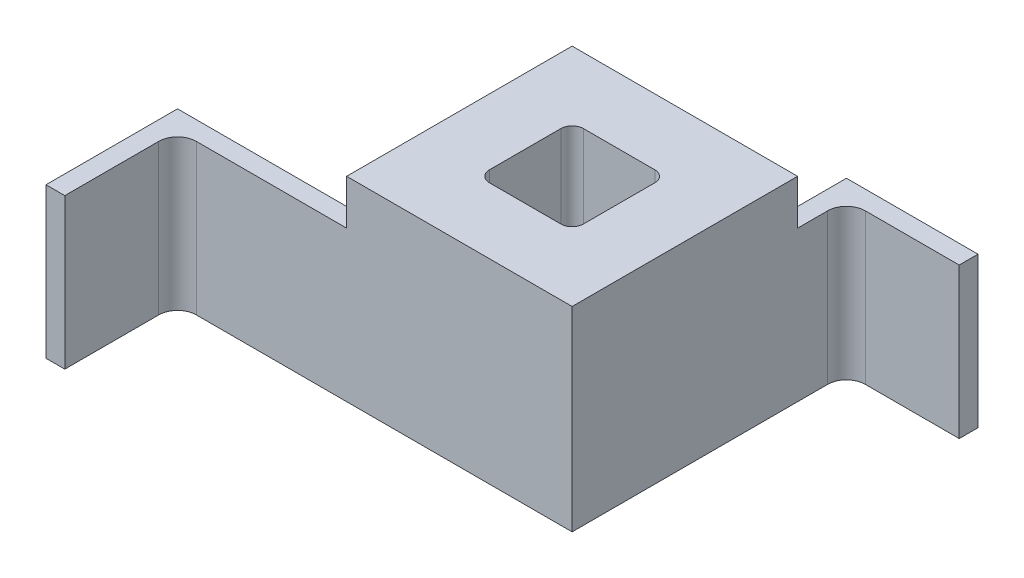
ISO-10303-21;
HEADER;
FILE_DESCRIPTION(('STEP AP214'),'2;1');
FILE_NAME('part.step','',(''),(''),'','','');
FILE_SCHEMA(('AUTOMOTIVE_DESIGN { 1 0 10303 214 1 1 1 1 }'));
ENDSEC;
DATA;
#1=APPLICATION_CONTEXT('core data for automotive mechanical design processes');
#2=APPLICATION_PROTOCOL_DEFINITION('international standard','automotive_design',2000,#1);
#3=PRODUCT_CONTEXT('',#1,'mechanical');
#4=PRODUCT('Part','Part','',(#3));
#5=PRODUCT_RELATED_PRODUCT_CATEGORY('part','',(#4));
#6=PRODUCT_DEFINITION_FORMATION('','',#4);
#7=PRODUCT_DEFINITION_CONTEXT('part definition',#1,'design');
#8=PRODUCT_DEFINITION('design','',#6,#7);
#9=PRODUCT_DEFINITION_SHAPE('','',#8);
#10=(LENGTH_UNIT() NAMED_UNIT(*) SI_UNIT(.MILLI.,.METRE.));
#11=(NAMED_UNIT(*) PLANE_ANGLE_UNIT() SI_UNIT($,.RADIAN.));
#12=(NAMED_UNIT(*) SI_UNIT($,.STERADIAN.) SOLID_ANGLE_UNIT());
#13=UNCERTAINTY_MEASURE_WITH_UNIT(LENGTH_MEASURE(1.E-05),#10,'distance_accuracy_value','');
#14=(GEOMETRIC_REPRESENTATION_CONTEXT(3) GLOBAL_UNCERTAINTY_ASSIGNED_CONTEXT((#13)) GLOBAL_UNIT_ASSIGNED_CONTEXT((#10,
#11,#12)) REPRESENTATION_CONTEXT('',''));
#15=CARTESIAN_POINT('',(0.,0.,0.));
#16=DIRECTION('',(0.,0.,1.));
#17=DIRECTION('',(1.,0.,0.));
#18=AXIS2_PLACEMENT_3D('',#15,#16,#17);
#19=CARTESIAN_POINT('',(-30.,51.95,30.));
#20=DIRECTION('',(0.,0.,-1.));
#21=DIRECTION('',(-1.,0.,0.));
#22=AXIS2_PLACEMENT_3D('',#19,#20,#21);
#23=PLANE('',#22);
#24=DIRECTION('',(1.,0.,0.));
#25=VECTOR('',#24,1.);
#26=CARTESIAN_POINT('',(-80.,40.,30.));
#27=LINE('',#26,#25);
#28=CARTESIAN_POINT('',(-70.,40.,30.));
#29=VERTEX_POINT('',#28);
#30=CARTESIAN_POINT('',(-30.,40.,30.));
#31=VERTEX_POINT('',#30);
#32=EDGE_CURVE('E258',#29,#31,#27,.T.);
#33=ORIENTED_EDGE('',*,*,#32,.F.);
#34=DIRECTION('',(0.,1.,0.));
#35=VECTOR('',#34,1.);
#36=CARTESIAN_POINT('',(-70.,0.,30.));
#37=LINE('',#36,#35);
#38=CARTESIAN_POINT('',(-70.,0.,30.));
#39=VERTEX_POINT('',#38);
#40=EDGE_CURVE('E362',#29,#39,#37,.F.);
#41=ORIENTED_EDGE('',*,*,#40,.T.);
#42=DIRECTION('',(1.,0.,0.));
#43=VECTOR('',#42,1.);
#44=CARTESIAN_POINT('',(-30.,0.,30.));
#45=LINE('',#44,#43);
#46=CARTESIAN_POINT('',(30.,0.,30.));
#47=VERTEX_POINT('',#46);
#48=EDGE_CURVE('E298',#39,#47,#45,.T.);
#49=ORIENTED_EDGE('',*,*,#48,.T.);
#50=DIRECTION('',(0.,-1.,0.));
#51=VECTOR('',#50,1.);
#52=CARTESIAN_POINT('',(30.,51.95,30.));
#53=LINE('',#52,#51);
#54=CARTESIAN_POINT('',(30.,51.95,30.));
#55=VERTEX_POINT('',#54);
#56=EDGE_CURVE('E304',#55,#47,#53,.T.);
#57=ORIENTED_EDGE('',*,*,#56,.F.);
#58=DIRECTION('',(1.,0.,0.));
#59=VECTOR('',#58,1.);
#60=CARTESIAN_POINT('',(-30.,51.95,30.));
#61=LINE('',#60,#59);
#62=CARTESIAN_POINT('',(-30.,51.95,30.));
#63=VERTEX_POINT('',#62);
#64=EDGE_CURVE('E302',#63,#55,#61,.T.);
#65=ORIENTED_EDGE('',*,*,#64,.F.);
#66=DIRECTION('',(0.,-1.,0.));
#67=VECTOR('',#66,1.);
#68=CARTESIAN_POINT('',(-30.,51.95,30.));
#69=LINE('',#68,#67);
#70=EDGE_CURVE('E314',#63,#31,#69,.T.);
#71=ORIENTED_EDGE('',*,*,#70,.T.);
#72=EDGE_LOOP('',(#33,#41,#49,#57,#65,#71));
#73=FACE_BOUND('',#72,.T.);
#74=ADVANCED_FACE('F39',(#73),#23,.F.);
#75=CARTESIAN_POINT('',(-30.,51.95,-30.));
#76=DIRECTION('',(1.,0.,0.));
#77=DIRECTION('',(0.,0.,-1.));
#78=AXIS2_PLACEMENT_3D('',#75,#76,#77);
#79=PLANE('',#78);
#80=DIRECTION('',(0.,0.,1.));
#81=VECTOR('',#80,1.);
#82=CARTESIAN_POINT('',(-30.,0.,-30.));
#83=LINE('',#82,#81);
#84=CARTESIAN_POINT('',(-30.,0.,-30.));
#85=VERTEX_POINT('',#84);
#86=CARTESIAN_POINT('',(-30.,0.,20.));
#87=VERTEX_POINT('',#86);
#88=EDGE_CURVE('E309',#85,#87,#83,.T.);
#89=ORIENTED_EDGE('',*,*,#88,.T.);
#90=DIRECTION('',(0.,-1.,0.));
#91=VECTOR('',#90,1.);
#92=CARTESIAN_POINT('',(-30.,40.,20.));
#93=LINE('',#92,#91);
#94=CARTESIAN_POINT('',(-30.,40.,20.));
#95=VERTEX_POINT('',#94);
#96=EDGE_CURVE('E385',#87,#95,#93,.F.);
#97=ORIENTED_EDGE('',*,*,#96,.T.);
#98=DIRECTION('',(0.,0.,-1.));
#99=VECTOR('',#98,1.);
#100=CARTESIAN_POINT('',(-30.,40.,30.));
#101=LINE('',#100,#99);
#102=EDGE_CURVE('E53',#31,#95,#101,.T.);
#103=ORIENTED_EDGE('',*,*,#102,.F.);
#104=ORIENTED_EDGE('',*,*,#70,.F.);
#105=DIRECTION('',(0.,0.,1.));
#106=VECTOR('',#105,1.);
#107=CARTESIAN_POINT('',(-30.,51.95,-30.));
#108=LINE('',#107,#106);
#109=CARTESIAN_POINT('',(-30.,51.95,-30.));
#110=VERTEX_POINT('',#109);
#111=EDGE_CURVE('E300',#110,#63,#108,.T.);
#112=ORIENTED_EDGE('',*,*,#111,.F.);
#113=DIRECTION('',(0.,-1.,0.));
#114=VECTOR('',#113,1.);
#115=CARTESIAN_POINT('',(-30.,51.95,-30.));
#116=LINE('',#115,#114);
#117=EDGE_CURVE('E317',#110,#85,#116,.T.);
#118=ORIENTED_EDGE('',*,*,#117,.T.);
#119=EDGE_LOOP('',(#89,#97,#103,#104,#112,#118));
#120=FACE_BOUND('',#119,.T.);
#121=ADVANCED_FACE('F456',(#120),#79,.F.);
#122=CARTESIAN_POINT('',(30.,51.95,-30.));
#123=DIRECTION('',(-1.,0.,0.));
#124=DIRECTION('',(0.,0.,1.));
#125=AXIS2_PLACEMENT_3D('',#122,#123,#124);
#126=PLANE('',#125);
#127=DIRECTION('',(0.,0.,-1.));
#128=VECTOR('',#127,1.);
#129=CARTESIAN_POINT('',(30.,0.,-30.));
#130=LINE('',#129,#128);
#131=CARTESIAN_POINT('',(30.,0.,-38.));
#132=VERTEX_POINT('',#131);
#133=EDGE_CURVE('E293',#47,#132,#130,.T.);
#134=ORIENTED_EDGE('',*,*,#133,.T.);
#135=DIRECTION('',(0.,-1.,0.));
#136=VECTOR('',#135,1.);
#137=CARTESIAN_POINT('',(30.,40.,-38.));
#138=LINE('',#137,#136);
#139=CARTESIAN_POINT('',(30.,40.,-38.));
#140=VERTEX_POINT('',#139);
#141=EDGE_CURVE('E367',#132,#140,#138,.F.);
#142=ORIENTED_EDGE('',*,*,#141,.T.);
#143=DIRECTION('',(0.,0.,1.));
#144=VECTOR('',#143,1.);
#145=CARTESIAN_POINT('',(30.,40.,-48.));
#146=LINE('',#145,#144);
#147=CARTESIAN_POINT('',(30.,40.,-30.));
#148=VERTEX_POINT('',#147);
#149=EDGE_CURVE('E283',#140,#148,#146,.T.);
#150=ORIENTED_EDGE('',*,*,#149,.T.);
#151=DIRECTION('',(0.,-1.,0.));
#152=VECTOR('',#151,1.);
#153=CARTESIAN_POINT('',(30.,51.95,-30.));
#154=LINE('',#153,#152);
#155=CARTESIAN_POINT('',(30.,51.95,-30.));
#156=VERTEX_POINT('',#155);
#157=EDGE_CURVE('E320',#156,#148,#154,.T.);
#158=ORIENTED_EDGE('',*,*,#157,.F.);
#159=DIRECTION('',(0.,0.,-1.));
#160=VECTOR('',#159,1.);
#161=CARTESIAN_POINT('',(30.,51.95,-30.));
#162=LINE('',#161,#160);
#163=EDGE_CURVE('E294',#55,#156,#162,.T.);
#164=ORIENTED_EDGE('',*,*,#163,.F.);
#165=ORIENTED_EDGE('',*,*,#56,.T.);
#166=EDGE_LOOP('',(#134,#142,#150,#158,#164,#165));
#167=FACE_BOUND('',#166,.T.);
#168=ADVANCED_FACE('F423',(#167),#126,.F.);
#169=CARTESIAN_POINT('',(-30.,51.95,-30.));
#170=DIRECTION('',(0.,0.,1.));
#171=DIRECTION('',(1.,0.,0.));
#172=AXIS2_PLACEMENT_3D('',#169,#170,#171);
#173=PLANE('',#172);
#174=DIRECTION('',(1.,0.,0.));
#175=VECTOR('',#174,1.);
#176=CARTESIAN_POINT('',(30.,40.,-30.));
#177=LINE('',#176,#175);
#178=CARTESIAN_POINT('',(20.,40.,-30.));
#179=VERTEX_POINT('',#178);
#180=EDGE_CURVE('E276',#179,#148,#177,.T.);
#181=ORIENTED_EDGE('',*,*,#180,.F.);
#182=DIRECTION('',(0.,1.,0.));
#183=VECTOR('',#182,1.);
#184=CARTESIAN_POINT('',(20.,0.,-30.));
#185=LINE('',#184,#183);
#186=CARTESIAN_POINT('',(20.,0.,-30.));
#187=VERTEX_POINT('',#186);
#188=EDGE_CURVE('E380',#179,#187,#185,.F.);
#189=ORIENTED_EDGE('',*,*,#188,.T.);
#190=DIRECTION('',(-1.,0.,0.));
#191=VECTOR('',#190,1.);
#192=CARTESIAN_POINT('',(-30.,0.,-30.));
#193=LINE('',#192,#191);
#194=EDGE_CURVE('E307',#187,#85,#193,.T.);
#195=ORIENTED_EDGE('',*,*,#194,.T.);
#196=ORIENTED_EDGE('',*,*,#117,.F.);
#197=DIRECTION('',(-1.,0.,0.));
#198=VECTOR('',#197,1.);
#199=CARTESIAN_POINT('',(-30.,51.95,-30.));
#200=LINE('',#199,#198);
#201=EDGE_CURVE('E297',#156,#110,#200,.T.);
#202=ORIENTED_EDGE('',*,*,#201,.F.);
#203=ORIENTED_EDGE('',*,*,#157,.T.);
#204=EDGE_LOOP('',(#181,#189,#195,#196,#202,#203));
#205=FACE_BOUND('',#204,.T.);
#206=ADVANCED_FACE('F430',(#205),#173,.F.);
#207=CARTESIAN_POINT('',(0.,51.95,0.));
#208=DIRECTION('',(0.,1.,0.));
#209=DIRECTION('',(0.,0.,1.));
#210=AXIS2_PLACEMENT_3D('',#207,#208,#209);
#211=PLANE('',#210);
#212=DIRECTION('',(0.,0.,-1.));
#213=VECTOR('',#212,1.);
#214=CARTESIAN_POINT('',(12.5,51.95,-12.5));
#215=LINE('',#214,#213);
#216=CARTESIAN_POINT('',(12.5,51.95,9.49999999999999));
#217=VERTEX_POINT('',#216);
#218=CARTESIAN_POINT('',(12.5,51.95,-9.50000000000001));
#219=VERTEX_POINT('',#218);
#220=EDGE_CURVE('E713',#217,#219,#215,.T.);
#221=ORIENTED_EDGE('',*,*,#220,.F.);
#222=CARTESIAN_POINT('',(9.5,51.95,9.49999999999999));
#223=DIRECTION('',(0.,1.,0.));
#224=DIRECTION('',(0.,0.,1.));
#225=AXIS2_PLACEMENT_3D('',#222,#223,#224);
#226=CIRCLE('',#225,3.);
#227=CARTESIAN_POINT('',(9.5,51.95,12.5));
#228=VERTEX_POINT('',#227);
#229=EDGE_CURVE('E347',#217,#228,#226,.F.);
#230=ORIENTED_EDGE('',*,*,#229,.T.);
#231=DIRECTION('',(1.,0.,0.));
#232=VECTOR('',#231,1.);
#233=CARTESIAN_POINT('',(-12.5,51.95,12.5));
#234=LINE('',#233,#232);
#235=CARTESIAN_POINT('',(-9.5,51.95,12.5));
#236=VERTEX_POINT('',#235);
#237=EDGE_CURVE('E241',#236,#228,#234,.T.);
#238=ORIENTED_EDGE('',*,*,#237,.F.);
#239=CARTESIAN_POINT('',(-9.5,51.95,9.49999999999999));
#240=DIRECTION('',(0.,1.,0.));
#241=DIRECTION('',(0.,0.,1.));
#242=AXIS2_PLACEMENT_3D('',#239,#240,#241);
#243=CIRCLE('',#242,3.);
#244=CARTESIAN_POINT('',(-12.5,51.95,9.49999999999999));
#245=VERTEX_POINT('',#244);
#246=EDGE_CURVE('E343',#236,#245,#243,.F.);
#247=ORIENTED_EDGE('',*,*,#246,.T.);
#248=DIRECTION('',(0.,0.,1.));
#249=VECTOR('',#248,1.);
#250=CARTESIAN_POINT('',(-12.5,51.95,-12.5));
#251=LINE('',#250,#249);
#252=CARTESIAN_POINT('',(-12.5,51.95,-9.50000000000001));
#253=VERTEX_POINT('',#252);
#254=EDGE_CURVE('E721',#253,#245,#251,.T.);
#255=ORIENTED_EDGE('',*,*,#254,.F.);
#256=CARTESIAN_POINT('',(-9.50000000000001,51.95,-9.50000000000001));
#257=DIRECTION('',(0.,1.,0.));
#258=DIRECTION('',(0.,0.,1.));
#259=AXIS2_PLACEMENT_3D('',#256,#257,#258);
#260=CIRCLE('',#259,3.);
#261=CARTESIAN_POINT('',(-9.50000000000001,51.95,-12.5));
#262=VERTEX_POINT('',#261);
#263=EDGE_CURVE('E355',#253,#262,#260,.F.);
#264=ORIENTED_EDGE('',*,*,#263,.T.);
#265=DIRECTION('',(-1.,0.,0.));
#266=VECTOR('',#265,1.);
#267=CARTESIAN_POINT('',(-12.5,51.95,-12.5));
#268=LINE('',#267,#266);
#269=CARTESIAN_POINT('',(9.49999999999999,51.95,-12.5));
#270=VERTEX_POINT('',#269);
#271=EDGE_CURVE('E718',#270,#262,#268,.T.);
#272=ORIENTED_EDGE('',*,*,#271,.F.);
#273=CARTESIAN_POINT('',(9.49999999999999,51.95,-9.50000000000001));
#274=DIRECTION('',(0.,1.,0.));
#275=DIRECTION('',(0.,0.,1.));
#276=AXIS2_PLACEMENT_3D('',#273,#274,#275);
#277=CIRCLE('',#276,3.);
#278=EDGE_CURVE('E351',#270,#219,#277,.F.);
#279=ORIENTED_EDGE('',*,*,#278,.T.);
#280=EDGE_LOOP('',(#221,#230,#238,#247,#255,#264,#272,#279));
#281=FACE_BOUND('',#280,.T.);
#282=ORIENTED_EDGE('',*,*,#163,.T.);
#283=ORIENTED_EDGE('',*,*,#201,.T.);
#284=ORIENTED_EDGE('',*,*,#111,.T.);
#285=ORIENTED_EDGE('',*,*,#64,.T.);
#286=EDGE_LOOP('',(#282,#283,#284,#285));
#287=FACE_BOUND('',#286,.T.);
#288=ADVANCED_FACE('F434',(#281,#287),#211,.T.);
#289=CARTESIAN_POINT('',(0.,0.,0.));
#290=DIRECTION('',(0.,1.,0.));
#291=DIRECTION('',(0.,0.,1.));
#292=AXIS2_PLACEMENT_3D('',#289,#290,#291);
#293=PLANE('',#292);
#294=DIRECTION('',(0.,0.,1.));
#295=VECTOR('',#294,1.);
#296=CARTESIAN_POINT('',(-12.5,0.,-12.5));
#297=LINE('',#296,#295);
#298=CARTESIAN_POINT('',(-12.5,0.,-9.50000000000001));
#299=VERTEX_POINT('',#298);
#300=CARTESIAN_POINT('',(-12.5,0.,9.49999999999999));
#301=VERTEX_POINT('',#300);
#302=EDGE_CURVE('E238',#299,#301,#297,.T.);
#303=ORIENTED_EDGE('',*,*,#302,.T.);
#304=CARTESIAN_POINT('',(-9.5,0.,9.49999999999999));
#305=DIRECTION('',(0.,1.,0.));
#306=DIRECTION('',(0.,0.,1.));
#307=AXIS2_PLACEMENT_3D('',#304,#305,#306);
#308=CIRCLE('',#307,3.);
#309=CARTESIAN_POINT('',(-9.5,0.,12.5));
#310=VERTEX_POINT('',#309);
#311=EDGE_CURVE('E345',#301,#310,#308,.T.);
#312=ORIENTED_EDGE('',*,*,#311,.T.);
#313=DIRECTION('',(1.,0.,0.));
#314=VECTOR('',#313,1.);
#315=CARTESIAN_POINT('',(-12.5,0.,12.5));
#316=LINE('',#315,#314);
#317=CARTESIAN_POINT('',(9.5,0.,12.5));
#318=VERTEX_POINT('',#317);
#319=EDGE_CURVE('E235',#310,#318,#316,.T.);
#320=ORIENTED_EDGE('',*,*,#319,.T.);
#321=CARTESIAN_POINT('',(9.5,0.,9.49999999999999));
#322=DIRECTION('',(0.,1.,0.));
#323=DIRECTION('',(0.,0.,1.));
#324=AXIS2_PLACEMENT_3D('',#321,#322,#323);
#325=CIRCLE('',#324,3.);
#326=CARTESIAN_POINT('',(12.5,0.,9.49999999999999));
#327=VERTEX_POINT('',#326);
#328=EDGE_CURVE('E349',#318,#327,#325,.T.);
#329=ORIENTED_EDGE('',*,*,#328,.T.);
#330=DIRECTION('',(0.,0.,-1.));
#331=VECTOR('',#330,1.);
#332=CARTESIAN_POINT('',(12.5,0.,-12.5));
#333=LINE('',#332,#331);
#334=CARTESIAN_POINT('',(12.5,0.,-9.50000000000001));
#335=VERTEX_POINT('',#334);
#336=EDGE_CURVE('E727',#327,#335,#333,.T.);
#337=ORIENTED_EDGE('',*,*,#336,.T.);
#338=CARTESIAN_POINT('',(9.49999999999999,0.,-9.50000000000001));
#339=DIRECTION('',(0.,1.,0.));
#340=DIRECTION('',(0.,0.,1.));
#341=AXIS2_PLACEMENT_3D('',#338,#339,#340);
#342=CIRCLE('',#341,3.);
#343=CARTESIAN_POINT('',(9.49999999999999,0.,-12.5));
#344=VERTEX_POINT('',#343);
#345=EDGE_CURVE('E353',#335,#344,#342,.T.);
#346=ORIENTED_EDGE('',*,*,#345,.T.);
#347=DIRECTION('',(-1.,0.,0.));
#348=VECTOR('',#347,1.);
#349=CARTESIAN_POINT('',(-12.5,0.,-12.5));
#350=LINE('',#349,#348);
#351=CARTESIAN_POINT('',(-9.50000000000001,0.,-12.5));
#352=VERTEX_POINT('',#351);
#353=EDGE_CURVE('E730',#344,#352,#350,.T.);
#354=ORIENTED_EDGE('',*,*,#353,.T.);
#355=CARTESIAN_POINT('',(-9.50000000000001,0.,-9.50000000000001));
#356=DIRECTION('',(0.,1.,0.));
#357=DIRECTION('',(0.,0.,1.));
#358=AXIS2_PLACEMENT_3D('',#355,#356,#357);
#359=CIRCLE('',#358,3.);
#360=EDGE_CURVE('E357',#352,#299,#359,.T.);
#361=ORIENTED_EDGE('',*,*,#360,.T.);
#362=EDGE_LOOP('',(#303,#312,#320,#329,#337,#346,#354,#361));
#363=FACE_BOUND('',#362,.T.);
#364=ORIENTED_EDGE('',*,*,#133,.F.);
#365=ORIENTED_EDGE('',*,*,#48,.F.);
#366=CARTESIAN_POINT('',(-70.,0.,35.));
#367=DIRECTION('',(0.,1.,0.));
#368=DIRECTION('',(0.,0.,1.));
#369=AXIS2_PLACEMENT_3D('',#366,#367,#368);
#370=CIRCLE('',#369,5.);
#371=CARTESIAN_POINT('',(-75.,0.,35.));
#372=VERTEX_POINT('',#371);
#373=EDGE_CURVE('E371',#39,#372,#370,.T.);
#374=ORIENTED_EDGE('',*,*,#373,.T.);
#375=DIRECTION('',(0.,0.,-1.));
#376=VECTOR('',#375,1.);
#377=CARTESIAN_POINT('',(-75.,0.,60.));
#378=LINE('',#377,#376);
#379=CARTESIAN_POINT('',(-75.,0.,60.));
#380=VERTEX_POINT('',#379);
#381=EDGE_CURVE('E226',#380,#372,#378,.T.);
#382=ORIENTED_EDGE('',*,*,#381,.F.);
#383=DIRECTION('',(1.,0.,0.));
#384=VECTOR('',#383,1.);
#385=CARTESIAN_POINT('',(-80.,0.,60.));
#386=LINE('',#385,#384);
#387=CARTESIAN_POINT('',(-80.,0.,60.));
#388=VERTEX_POINT('',#387);
#389=EDGE_CURVE('E222',#388,#380,#386,.T.);
#390=ORIENTED_EDGE('',*,*,#389,.F.);
#391=DIRECTION('',(0.,0.,1.));
#392=VECTOR('',#391,1.);
#393=CARTESIAN_POINT('',(-80.,0.,30.));
#394=LINE('',#393,#392);
#395=CARTESIAN_POINT('',(-80.,0.,25.));
#396=VERTEX_POINT('',#395);
#397=EDGE_CURVE('E211',#396,#388,#394,.T.);
#398=ORIENTED_EDGE('',*,*,#397,.F.);
#399=DIRECTION('',(1.,0.,0.));
#400=VECTOR('',#399,1.);
#401=CARTESIAN_POINT('',(-80.,0.,25.));
#402=LINE('',#401,#400);
#403=CARTESIAN_POINT('',(-35.,0.,25.));
#404=VERTEX_POINT('',#403);
#405=EDGE_CURVE('E219',#396,#404,#402,.T.);
#406=ORIENTED_EDGE('',*,*,#405,.T.);
#407=CARTESIAN_POINT('',(-35.,0.,20.));
#408=DIRECTION('',(0.,1.,0.));
#409=DIRECTION('',(0.,0.,1.));
#410=AXIS2_PLACEMENT_3D('',#407,#408,#409);
#411=CIRCLE('',#410,5.);
#412=EDGE_CURVE('E47',#404,#87,#411,.T.);
#413=ORIENTED_EDGE('',*,*,#412,.T.);
#414=ORIENTED_EDGE('',*,*,#88,.F.);
#415=ORIENTED_EDGE('',*,*,#194,.F.);
#416=CARTESIAN_POINT('',(20.,0.,-35.));
#417=DIRECTION('',(0.,1.,0.));
#418=DIRECTION('',(0.,0.,1.));
#419=AXIS2_PLACEMENT_3D('',#416,#417,#418);
#420=CIRCLE('',#419,5.);
#421=CARTESIAN_POINT('',(25.,0.,-35.));
#422=VERTEX_POINT('',#421);
#423=EDGE_CURVE('E390',#187,#422,#420,.T.);
#424=ORIENTED_EDGE('',*,*,#423,.T.);
#425=DIRECTION('',(0.,0.,1.));
#426=VECTOR('',#425,1.);
#427=CARTESIAN_POINT('',(25.,0.,-48.));
#428=LINE('',#427,#426);
#429=CARTESIAN_POINT('',(25.,0.,-48.));
#430=VERTEX_POINT('',#429);
#431=EDGE_CURVE('E290',#430,#422,#428,.T.);
#432=ORIENTED_EDGE('',*,*,#431,.F.);
#433=DIRECTION('',(-1.,0.,0.));
#434=VECTOR('',#433,1.);
#435=CARTESIAN_POINT('',(30.,0.,-48.));
#436=LINE('',#435,#434);
#437=CARTESIAN_POINT('',(60.,0.,-48.));
#438=VERTEX_POINT('',#437);
#439=EDGE_CURVE('E277',#438,#430,#436,.T.);
#440=ORIENTED_EDGE('',*,*,#439,.F.);
#441=DIRECTION('',(0.,0.,-1.));
#442=VECTOR('',#441,1.);
#443=CARTESIAN_POINT('',(60.,0.,-48.));
#444=LINE('',#443,#442);
#445=CARTESIAN_POINT('',(60.,0.,-43.));
#446=VERTEX_POINT('',#445);
#447=EDGE_CURVE('E267',#446,#438,#444,.T.);
#448=ORIENTED_EDGE('',*,*,#447,.F.);
#449=DIRECTION('',(-1.,0.,0.));
#450=VECTOR('',#449,1.);
#451=CARTESIAN_POINT('',(60.,0.,-43.));
#452=LINE('',#451,#450);
#453=CARTESIAN_POINT('',(35.,0.,-43.));
#454=VERTEX_POINT('',#453);
#455=EDGE_CURVE('E270',#446,#454,#452,.T.);
#456=ORIENTED_EDGE('',*,*,#455,.T.);
#457=CARTESIAN_POINT('',(35.,0.,-38.));
#458=DIRECTION('',(0.,1.,0.));
#459=DIRECTION('',(0.,0.,1.));
#460=AXIS2_PLACEMENT_3D('',#457,#458,#459);
#461=CIRCLE('',#460,5.);
#462=EDGE_CURVE('E373',#454,#132,#461,.T.);
#463=ORIENTED_EDGE('',*,*,#462,.T.);
#464=EDGE_LOOP('',(#364,#365,#374,#382,#390,#398,#406,#413,#414,#415,#424,#432,#440,#448,#456,#463));
#465=FACE_BOUND('',#464,.T.);
#466=ADVANCED_FACE('F224',(#363,#465),#293,.F.);
#467=CARTESIAN_POINT('',(25.,40.,-48.));
#468=DIRECTION('',(1.,0.,0.));
#469=DIRECTION('',(0.,1.,0.));
#470=AXIS2_PLACEMENT_3D('',#467,#468,#469);
#471=PLANE('',#470);
#472=ORIENTED_EDGE('',*,*,#431,.T.);
#473=DIRECTION('',(0.,1.,0.));
#474=VECTOR('',#473,1.);
#475=CARTESIAN_POINT('',(25.,40.,-35.));
#476=LINE('',#475,#474);
#477=CARTESIAN_POINT('',(25.,40.,-35.));
#478=VERTEX_POINT('',#477);
#479=EDGE_CURVE('E377',#422,#478,#476,.T.);
#480=ORIENTED_EDGE('',*,*,#479,.T.);
#481=DIRECTION('',(0.,0.,1.));
#482=VECTOR('',#481,1.);
#483=CARTESIAN_POINT('',(25.,40.,-48.));
#484=LINE('',#483,#482);
#485=CARTESIAN_POINT('',(25.,40.,-48.));
#486=VERTEX_POINT('',#485);
#487=EDGE_CURVE('E287',#486,#478,#484,.T.);
#488=ORIENTED_EDGE('',*,*,#487,.F.);
#489=DIRECTION('',(0.,1.,0.));
#490=VECTOR('',#489,1.);
#491=CARTESIAN_POINT('',(25.,40.,-48.));
#492=LINE('',#491,#490);
#493=EDGE_CURVE('E279',#430,#486,#492,.T.);
#494=ORIENTED_EDGE('',*,*,#493,.F.);
#495=EDGE_LOOP('',(#472,#480,#488,#494));
#496=FACE_BOUND('',#495,.T.);
#497=ADVANCED_FACE('F399',(#496),#471,.F.);
#498=CARTESIAN_POINT('',(30.,40.,-48.));
#499=DIRECTION('',(0.,-1.,0.));
#500=DIRECTION('',(0.,0.,-1.));
#501=AXIS2_PLACEMENT_3D('',#498,#499,#500);
#502=PLANE('',#501);
#503=ORIENTED_EDGE('',*,*,#180,.T.);
#504=ORIENTED_EDGE('',*,*,#149,.F.);
#505=CARTESIAN_POINT('',(35.,40.,-38.));
#506=DIRECTION('',(0.,-1.,0.));
#507=DIRECTION('',(0.,0.,-1.));
#508=AXIS2_PLACEMENT_3D('',#505,#506,#507);
#509=CIRCLE('',#508,5.);
#510=CARTESIAN_POINT('',(35.,40.,-43.));
#511=VERTEX_POINT('',#510);
#512=EDGE_CURVE('E375',#140,#511,#509,.T.);
#513=ORIENTED_EDGE('',*,*,#512,.T.);
#514=DIRECTION('',(-1.,0.,0.));
#515=VECTOR('',#514,1.);
#516=CARTESIAN_POINT('',(60.,40.,-43.));
#517=LINE('',#516,#515);
#518=CARTESIAN_POINT('',(60.,40.,-43.));
#519=VERTEX_POINT('',#518);
#520=EDGE_CURVE('E273',#519,#511,#517,.T.);
#521=ORIENTED_EDGE('',*,*,#520,.F.);
#522=DIRECTION('',(0.,0.,1.));
#523=VECTOR('',#522,1.);
#524=CARTESIAN_POINT('',(60.,40.,-48.));
#525=LINE('',#524,#523);
#526=CARTESIAN_POINT('',(60.,40.,-48.));
#527=VERTEX_POINT('',#526);
#528=EDGE_CURVE('E263',#527,#519,#525,.T.);
#529=ORIENTED_EDGE('',*,*,#528,.F.);
#530=DIRECTION('',(1.,0.,0.));
#531=VECTOR('',#530,1.);
#532=CARTESIAN_POINT('',(30.,40.,-48.));
#533=LINE('',#532,#531);
#534=EDGE_CURVE('E281',#486,#527,#533,.T.);
#535=ORIENTED_EDGE('',*,*,#534,.F.);
#536=ORIENTED_EDGE('',*,*,#487,.T.);
#537=CARTESIAN_POINT('',(20.,40.,-35.));
#538=DIRECTION('',(0.,-1.,0.));
#539=DIRECTION('',(0.,0.,-1.));
#540=AXIS2_PLACEMENT_3D('',#537,#538,#539);
#541=CIRCLE('',#540,5.);
#542=EDGE_CURVE('E387',#478,#179,#541,.T.);
#543=ORIENTED_EDGE('',*,*,#542,.T.);
#544=EDGE_LOOP('',(#503,#504,#513,#521,#529,#535,#536,#543));
#545=FACE_BOUND('',#544,.T.);
#546=ADVANCED_FACE('F403',(#545),#502,.F.);
#547=CARTESIAN_POINT('',(0.,0.,-48.));
#548=DIRECTION('',(0.,0.,-1.));
#549=DIRECTION('',(-1.,0.,0.));
#550=AXIS2_PLACEMENT_3D('',#547,#548,#549);
#551=PLANE('',#550);
#552=ORIENTED_EDGE('',*,*,#534,.T.);
#553=DIRECTION('',(0.,1.,0.));
#554=VECTOR('',#553,1.);
#555=CARTESIAN_POINT('',(60.,40.,-48.));
#556=LINE('',#555,#554);
#557=EDGE_CURVE('E260',#438,#527,#556,.T.);
#558=ORIENTED_EDGE('',*,*,#557,.F.);
#559=ORIENTED_EDGE('',*,*,#439,.T.);
#560=ORIENTED_EDGE('',*,*,#493,.T.);
#561=EDGE_LOOP('',(#552,#558,#559,#560));
#562=FACE_BOUND('',#561,.T.);
#563=ADVANCED_FACE('F410',(#562),#551,.T.);
#564=CARTESIAN_POINT('',(60.,40.,-43.));
#565=DIRECTION('',(0.,0.,-1.));
#566=DIRECTION('',(-1.,0.,0.));
#567=AXIS2_PLACEMENT_3D('',#564,#565,#566);
#568=PLANE('',#567);
#569=ORIENTED_EDGE('',*,*,#520,.T.);
#570=DIRECTION('',(0.,-1.,0.));
#571=VECTOR('',#570,1.);
#572=CARTESIAN_POINT('',(35.,0.,-43.));
#573=LINE('',#572,#571);
#574=EDGE_CURVE('E364',#511,#454,#573,.T.);
#575=ORIENTED_EDGE('',*,*,#574,.T.);
#576=ORIENTED_EDGE('',*,*,#455,.F.);
#577=DIRECTION('',(0.,-1.,0.));
#578=VECTOR('',#577,1.);
#579=CARTESIAN_POINT('',(60.,40.,-43.));
#580=LINE('',#579,#578);
#581=EDGE_CURVE('E265',#519,#446,#580,.T.);
#582=ORIENTED_EDGE('',*,*,#581,.F.);
#583=EDGE_LOOP('',(#569,#575,#576,#582));
#584=FACE_BOUND('',#583,.T.);
#585=ADVANCED_FACE('F417',(#584),#568,.F.);
#586=CARTESIAN_POINT('',(60.,0.,0.));
#587=DIRECTION('',(-1.,0.,0.));
#588=DIRECTION('',(0.,0.,1.));
#589=AXIS2_PLACEMENT_3D('',#586,#587,#588);
#590=PLANE('',#589);
#591=ORIENTED_EDGE('',*,*,#557,.T.);
#592=ORIENTED_EDGE('',*,*,#528,.T.);
#593=ORIENTED_EDGE('',*,*,#581,.T.);
#594=ORIENTED_EDGE('',*,*,#447,.T.);
#595=EDGE_LOOP('',(#591,#592,#593,#594));
#596=FACE_BOUND('',#595,.T.);
#597=ADVANCED_FACE('F413',(#596),#590,.F.);
#598=CARTESIAN_POINT('',(-80.,40.,30.));
#599=DIRECTION('',(0.,-1.,0.));
#600=DIRECTION('',(0.,0.,-1.));
#601=AXIS2_PLACEMENT_3D('',#598,#599,#600);
#602=PLANE('',#601);
#603=ORIENTED_EDGE('',*,*,#102,.T.);
#604=CARTESIAN_POINT('',(-35.,40.,20.));
#605=DIRECTION('',(0.,-1.,0.));
#606=DIRECTION('',(0.,0.,-1.));
#607=AXIS2_PLACEMENT_3D('',#604,#605,#606);
#608=CIRCLE('',#607,5.);
#609=CARTESIAN_POINT('',(-35.,40.,25.));
#610=VERTEX_POINT('',#609);
#611=EDGE_CURVE('E11',#95,#610,#608,.T.);
#612=ORIENTED_EDGE('',*,*,#611,.T.);
#613=DIRECTION('',(1.,0.,0.));
#614=VECTOR('',#613,1.);
#615=CARTESIAN_POINT('',(-80.,40.,25.));
#616=LINE('',#615,#614);
#617=CARTESIAN_POINT('',(-80.,40.,25.));
#618=VERTEX_POINT('',#617);
#619=EDGE_CURVE('E255',#618,#610,#616,.T.);
#620=ORIENTED_EDGE('',*,*,#619,.F.);
#621=DIRECTION('',(0.,0.,-1.));
#622=VECTOR('',#621,1.);
#623=CARTESIAN_POINT('',(-80.,40.,30.));
#624=LINE('',#623,#622);
#625=CARTESIAN_POINT('',(-80.,40.,60.));
#626=VERTEX_POINT('',#625);
#627=EDGE_CURVE('E250',#626,#618,#624,.T.);
#628=ORIENTED_EDGE('',*,*,#627,.F.);
#629=DIRECTION('',(-1.,0.,0.));
#630=VECTOR('',#629,1.);
#631=CARTESIAN_POINT('',(-80.,40.,60.));
#632=LINE('',#631,#630);
#633=CARTESIAN_POINT('',(-75.,40.,60.));
#634=VERTEX_POINT('',#633);
#635=EDGE_CURVE('E234',#634,#626,#632,.T.);
#636=ORIENTED_EDGE('',*,*,#635,.F.);
#637=DIRECTION('',(0.,0.,-1.));
#638=VECTOR('',#637,1.);
#639=CARTESIAN_POINT('',(-75.,40.,60.));
#640=LINE('',#639,#638);
#641=CARTESIAN_POINT('',(-75.,40.,35.));
#642=VERTEX_POINT('',#641);
#643=EDGE_CURVE('E246',#634,#642,#640,.T.);
#644=ORIENTED_EDGE('',*,*,#643,.T.);
#645=CARTESIAN_POINT('',(-70.,40.,35.));
#646=DIRECTION('',(0.,-1.,0.));
#647=DIRECTION('',(0.,0.,-1.));
#648=AXIS2_PLACEMENT_3D('',#645,#646,#647);
#649=CIRCLE('',#648,5.);
#650=EDGE_CURVE('E369',#642,#29,#649,.T.);
#651=ORIENTED_EDGE('',*,*,#650,.T.);
#652=ORIENTED_EDGE('',*,*,#32,.T.);
#653=EDGE_LOOP('',(#603,#612,#620,#628,#636,#644,#651,#652));
#654=FACE_BOUND('',#653,.T.);
#655=ADVANCED_FACE('F447',(#654),#602,.F.);
#656=CARTESIAN_POINT('',(-80.,40.,25.));
#657=DIRECTION('',(0.,0.,1.));
#658=DIRECTION('',(1.,0.,0.));
#659=AXIS2_PLACEMENT_3D('',#656,#657,#658);
#660=PLANE('',#659);
#661=ORIENTED_EDGE('',*,*,#619,.T.);
#662=DIRECTION('',(0.,-1.,0.));
#663=VECTOR('',#662,1.);
#664=CARTESIAN_POINT('',(-35.,0.,25.));
#665=LINE('',#664,#663);
#666=EDGE_CURVE('E382',#610,#404,#665,.T.);
#667=ORIENTED_EDGE('',*,*,#666,.T.);
#668=ORIENTED_EDGE('',*,*,#405,.F.);
#669=DIRECTION('',(0.,-1.,0.));
#670=VECTOR('',#669,1.);
#671=CARTESIAN_POINT('',(-80.,40.,25.));
#672=LINE('',#671,#670);
#673=EDGE_CURVE('E217',#618,#396,#672,.T.);
#674=ORIENTED_EDGE('',*,*,#673,.F.);
#675=EDGE_LOOP('',(#661,#667,#668,#674));
#676=FACE_BOUND('',#675,.T.);
#677=ADVANCED_FACE('F452',(#676),#660,.F.);
#678=CARTESIAN_POINT('',(-80.,0.,0.));
#679=DIRECTION('',(1.,0.,0.));
#680=DIRECTION('',(0.,0.,-1.));
#681=AXIS2_PLACEMENT_3D('',#678,#679,#680);
#682=PLANE('',#681);
#683=ORIENTED_EDGE('',*,*,#397,.T.);
#684=DIRECTION('',(0.,-1.,0.));
#685=VECTOR('',#684,1.);
#686=CARTESIAN_POINT('',(-80.,40.,60.));
#687=LINE('',#686,#685);
#688=EDGE_CURVE('E215',#626,#388,#687,.T.);
#689=ORIENTED_EDGE('',*,*,#688,.F.);
#690=ORIENTED_EDGE('',*,*,#627,.T.);
#691=ORIENTED_EDGE('',*,*,#673,.T.);
#692=EDGE_LOOP('',(#683,#689,#690,#691));
#693=FACE_BOUND('',#692,.T.);
#694=ADVANCED_FACE('F213',(#693),#682,.F.);
#695=CARTESIAN_POINT('',(-75.,40.,60.));
#696=DIRECTION('',(-1.,0.,0.));
#697=DIRECTION('',(0.,0.,1.));
#698=AXIS2_PLACEMENT_3D('',#695,#696,#697);
#699=PLANE('',#698);
#700=ORIENTED_EDGE('',*,*,#381,.T.);
#701=DIRECTION('',(0.,1.,0.));
#702=VECTOR('',#701,1.);
#703=CARTESIAN_POINT('',(-75.,40.,35.));
#704=LINE('',#703,#702);
#705=EDGE_CURVE('E359',#372,#642,#704,.T.);
#706=ORIENTED_EDGE('',*,*,#705,.T.);
#707=ORIENTED_EDGE('',*,*,#643,.F.);
#708=DIRECTION('',(0.,1.,0.));
#709=VECTOR('',#708,1.);
#710=CARTESIAN_POINT('',(-75.,40.,60.));
#711=LINE('',#710,#709);
#712=EDGE_CURVE('E229',#380,#634,#711,.T.);
#713=ORIENTED_EDGE('',*,*,#712,.F.);
#714=EDGE_LOOP('',(#700,#706,#707,#713));
#715=FACE_BOUND('',#714,.T.);
#716=ADVANCED_FACE('F446',(#715),#699,.F.);
#717=CARTESIAN_POINT('',(0.,0.,60.));
#718=DIRECTION('',(0.,0.,1.));
#719=DIRECTION('',(1.,0.,0.));
#720=AXIS2_PLACEMENT_3D('',#717,#718,#719);
#721=PLANE('',#720);
#722=ORIENTED_EDGE('',*,*,#688,.T.);
#723=ORIENTED_EDGE('',*,*,#389,.T.);
#724=ORIENTED_EDGE('',*,*,#712,.T.);
#725=ORIENTED_EDGE('',*,*,#635,.T.);
#726=EDGE_LOOP('',(#722,#723,#724,#725));
#727=FACE_BOUND('',#726,.T.);
#728=ADVANCED_FACE('F232',(#727),#721,.T.);
#729=CARTESIAN_POINT('',(12.5,0.,-12.5));
#730=DIRECTION('',(1.,0.,0.));
#731=DIRECTION('',(0.,0.,-1.));
#732=AXIS2_PLACEMENT_3D('',#729,#730,#731);
#733=PLANE('',#732);
#734=ORIENTED_EDGE('',*,*,#336,.F.);
#735=DIRECTION('',(0.,1.,0.));
#736=VECTOR('',#735,1.);
#737=CARTESIAN_POINT('',(12.5,51.95,9.49999999999999));
#738=LINE('',#737,#736);
#739=EDGE_CURVE('E335',#327,#217,#738,.T.);
#740=ORIENTED_EDGE('',*,*,#739,.T.);
#741=ORIENTED_EDGE('',*,*,#220,.T.);
#742=DIRECTION('',(0.,1.,0.));
#743=VECTOR('',#742,1.);
#744=CARTESIAN_POINT('',(12.5,0.,-9.50000000000001));
#745=LINE('',#744,#743);
#746=EDGE_CURVE('E333',#219,#335,#745,.F.);
#747=ORIENTED_EDGE('',*,*,#746,.T.);
#748=EDGE_LOOP('',(#734,#740,#741,#747));
#749=FACE_BOUND('',#748,.T.);
#750=ADVANCED_FACE('F567',(#749),#733,.F.);
#751=CARTESIAN_POINT('',(-12.5,0.,12.5));
#752=DIRECTION('',(0.,0.,1.));
#753=DIRECTION('',(1.,0.,0.));
#754=AXIS2_PLACEMENT_3D('',#751,#752,#753);
#755=PLANE('',#754);
#756=ORIENTED_EDGE('',*,*,#319,.F.);
#757=DIRECTION('',(0.,1.,0.));
#758=VECTOR('',#757,1.);
#759=CARTESIAN_POINT('',(-9.5,51.95,12.5));
#760=LINE('',#759,#758);
#761=EDGE_CURVE('E325',#310,#236,#760,.T.);
#762=ORIENTED_EDGE('',*,*,#761,.T.);
#763=ORIENTED_EDGE('',*,*,#237,.T.);
#764=DIRECTION('',(0.,1.,0.));
#765=VECTOR('',#764,1.);
#766=CARTESIAN_POINT('',(9.5,0.,12.5));
#767=LINE('',#766,#765);
#768=EDGE_CURVE('E323',#228,#318,#767,.F.);
#769=ORIENTED_EDGE('',*,*,#768,.T.);
#770=EDGE_LOOP('',(#756,#762,#763,#769));
#771=FACE_BOUND('',#770,.T.);
#772=ADVANCED_FACE('F557',(#771),#755,.F.);
#773=CARTESIAN_POINT('',(-12.5,0.,-12.5));
#774=DIRECTION('',(-1.,0.,0.));
#775=DIRECTION('',(0.,0.,1.));
#776=AXIS2_PLACEMENT_3D('',#773,#774,#775);
#777=PLANE('',#776);
#778=ORIENTED_EDGE('',*,*,#254,.T.);
#779=DIRECTION('',(0.,1.,0.));
#780=VECTOR('',#779,1.);
#781=CARTESIAN_POINT('',(-12.5,0.,9.49999999999999));
#782=LINE('',#781,#780);
#783=EDGE_CURVE('E331',#245,#301,#782,.F.);
#784=ORIENTED_EDGE('',*,*,#783,.T.);
#785=ORIENTED_EDGE('',*,*,#302,.F.);
#786=DIRECTION('',(0.,1.,0.));
#787=VECTOR('',#786,1.);
#788=CARTESIAN_POINT('',(-12.5,51.95,-9.50000000000001));
#789=LINE('',#788,#787);
#790=EDGE_CURVE('E328',#299,#253,#789,.T.);
#791=ORIENTED_EDGE('',*,*,#790,.T.);
#792=EDGE_LOOP('',(#778,#784,#785,#791));
#793=FACE_BOUND('',#792,.T.);
#794=ADVANCED_FACE('F547',(#793),#777,.F.);
#795=CARTESIAN_POINT('',(-12.5,0.,-12.5));
#796=DIRECTION('',(0.,0.,-1.));
#797=DIRECTION('',(-1.,0.,0.));
#798=AXIS2_PLACEMENT_3D('',#795,#796,#797);
#799=PLANE('',#798);
#800=ORIENTED_EDGE('',*,*,#353,.F.);
#801=DIRECTION('',(0.,1.,0.));
#802=VECTOR('',#801,1.);
#803=CARTESIAN_POINT('',(9.49999999999999,51.95,-12.5));
#804=LINE('',#803,#802);
#805=EDGE_CURVE('E340',#344,#270,#804,.T.);
#806=ORIENTED_EDGE('',*,*,#805,.T.);
#807=ORIENTED_EDGE('',*,*,#271,.T.);
#808=DIRECTION('',(0.,1.,0.));
#809=VECTOR('',#808,1.);
#810=CARTESIAN_POINT('',(-9.50000000000001,0.,-12.5));
#811=LINE('',#810,#809);
#812=EDGE_CURVE('E338',#262,#352,#811,.F.);
#813=ORIENTED_EDGE('',*,*,#812,.T.);
#814=EDGE_LOOP('',(#800,#806,#807,#813));
#815=FACE_BOUND('',#814,.T.);
#816=ADVANCED_FACE('F474',(#815),#799,.F.);
#817=CARTESIAN_POINT('',(-9.5,0.,9.49999999999999));
#818=DIRECTION('',(0.,-1.,0.));
#819=DIRECTION('',(0.,0.,-1.));
#820=AXIS2_PLACEMENT_3D('',#817,#818,#819);
#821=CYLINDRICAL_SURFACE('',#820,3.);
#822=ORIENTED_EDGE('',*,*,#311,.F.);
#823=ORIENTED_EDGE('',*,*,#783,.F.);
#824=ORIENTED_EDGE('',*,*,#246,.F.);
#825=ORIENTED_EDGE('',*,*,#761,.F.);
#826=EDGE_LOOP('',(#822,#823,#824,#825));
#827=FACE_BOUND('',#826,.T.);
#828=ADVANCED_FACE('F470',(#827),#821,.F.);
#829=CARTESIAN_POINT('',(9.5,0.,9.49999999999999));
#830=DIRECTION('',(0.,-1.,0.));
#831=DIRECTION('',(0.,0.,-1.));
#832=AXIS2_PLACEMENT_3D('',#829,#830,#831);
#833=CYLINDRICAL_SURFACE('',#832,3.);
#834=ORIENTED_EDGE('',*,*,#328,.F.);
#835=ORIENTED_EDGE('',*,*,#768,.F.);
#836=ORIENTED_EDGE('',*,*,#229,.F.);
#837=ORIENTED_EDGE('',*,*,#739,.F.);
#838=EDGE_LOOP('',(#834,#835,#836,#837));
#839=FACE_BOUND('',#838,.T.);
#840=ADVANCED_FACE('F473',(#839),#833,.F.);
#841=CARTESIAN_POINT('',(9.49999999999999,0.,-9.50000000000001));
#842=DIRECTION('',(0.,-1.,0.));
#843=DIRECTION('',(0.,0.,-1.));
#844=AXIS2_PLACEMENT_3D('',#841,#842,#843);
#845=CYLINDRICAL_SURFACE('',#844,3.);
#846=ORIENTED_EDGE('',*,*,#345,.F.);
#847=ORIENTED_EDGE('',*,*,#746,.F.);
#848=ORIENTED_EDGE('',*,*,#278,.F.);
#849=ORIENTED_EDGE('',*,*,#805,.F.);
#850=EDGE_LOOP('',(#846,#847,#848,#849));
#851=FACE_BOUND('',#850,.T.);
#852=ADVANCED_FACE('F478',(#851),#845,.F.);
#853=CARTESIAN_POINT('',(-9.50000000000001,0.,-9.50000000000001));
#854=DIRECTION('',(0.,-1.,0.));
#855=DIRECTION('',(0.,0.,-1.));
#856=AXIS2_PLACEMENT_3D('',#853,#854,#855);
#857=CYLINDRICAL_SURFACE('',#856,3.);
#858=ORIENTED_EDGE('',*,*,#360,.F.);
#859=ORIENTED_EDGE('',*,*,#812,.F.);
#860=ORIENTED_EDGE('',*,*,#263,.F.);
#861=ORIENTED_EDGE('',*,*,#790,.F.);
#862=EDGE_LOOP('',(#858,#859,#860,#861));
#863=FACE_BOUND('',#862,.T.);
#864=ADVANCED_FACE('F482',(#863),#857,.F.);
#865=CARTESIAN_POINT('',(-70.,40.,35.));
#866=DIRECTION('',(0.,-1.,0.));
#867=DIRECTION('',(0.,0.,-1.));
#868=AXIS2_PLACEMENT_3D('',#865,#866,#867);
#869=CYLINDRICAL_SURFACE('',#868,5.);
#870=ORIENTED_EDGE('',*,*,#373,.F.);
#871=ORIENTED_EDGE('',*,*,#40,.F.);
#872=ORIENTED_EDGE('',*,*,#650,.F.);
#873=ORIENTED_EDGE('',*,*,#705,.F.);
#874=EDGE_LOOP('',(#870,#871,#872,#873));
#875=FACE_BOUND('',#874,.T.);
#876=ADVANCED_FACE('F443',(#875),#869,.F.);
#877=CARTESIAN_POINT('',(35.,40.,-38.));
#878=DIRECTION('',(0.,1.,0.));
#879=DIRECTION('',(0.,0.,1.));
#880=AXIS2_PLACEMENT_3D('',#877,#878,#879);
#881=CYLINDRICAL_SURFACE('',#880,5.);
#882=ORIENTED_EDGE('',*,*,#512,.F.);
#883=ORIENTED_EDGE('',*,*,#141,.F.);
#884=ORIENTED_EDGE('',*,*,#462,.F.);
#885=ORIENTED_EDGE('',*,*,#574,.F.);
#886=EDGE_LOOP('',(#882,#883,#884,#885));
#887=FACE_BOUND('',#886,.T.);
#888=ADVANCED_FACE('F427',(#887),#881,.F.);
#889=CARTESIAN_POINT('',(20.,40.,-35.));
#890=DIRECTION('',(0.,-1.,0.));
#891=DIRECTION('',(1.,0.,0.));
#892=AXIS2_PLACEMENT_3D('',#889,#890,#891);
#893=CYLINDRICAL_SURFACE('',#892,5.);
#894=ORIENTED_EDGE('',*,*,#423,.F.);
#895=ORIENTED_EDGE('',*,*,#188,.F.);
#896=ORIENTED_EDGE('',*,*,#542,.F.);
#897=ORIENTED_EDGE('',*,*,#479,.F.);
#898=EDGE_LOOP('',(#894,#895,#896,#897));
#899=FACE_BOUND('',#898,.T.);
#900=ADVANCED_FACE('F401',(#899),#893,.F.);
#901=CARTESIAN_POINT('',(-35.,40.,20.));
#902=DIRECTION('',(0.,1.,0.));
#903=DIRECTION('',(0.,0.,1.));
#904=AXIS2_PLACEMENT_3D('',#901,#902,#903);
#905=CYLINDRICAL_SURFACE('',#904,5.);
#906=ORIENTED_EDGE('',*,*,#611,.F.);
#907=ORIENTED_EDGE('',*,*,#96,.F.);
#908=ORIENTED_EDGE('',*,*,#412,.F.);
#909=ORIENTED_EDGE('',*,*,#666,.F.);
#910=EDGE_LOOP('',(#906,#907,#908,#909));
#911=FACE_BOUND('',#910,.T.);
#912=ADVANCED_FACE('F41',(#911),#905,.F.);
#913=CLOSED_SHELL('',(#74,#121,#168,#206,#288,#466,#497,#546,#563,#585,#597,#655,#677,#694,#716,
#728,#750,#772,#794,#816,#828,#840,#852,#864,#876,#888,#900,#912));
#914=MANIFOLD_SOLID_BREP('B2',#913);
#915=ADVANCED_BREP_SHAPE_REPRESENTATION('',(#18,#914),#14);
#916=SHAPE_DEFINITION_REPRESENTATION(#9,#915);
ENDSEC;
END-ISO-10303-21;
